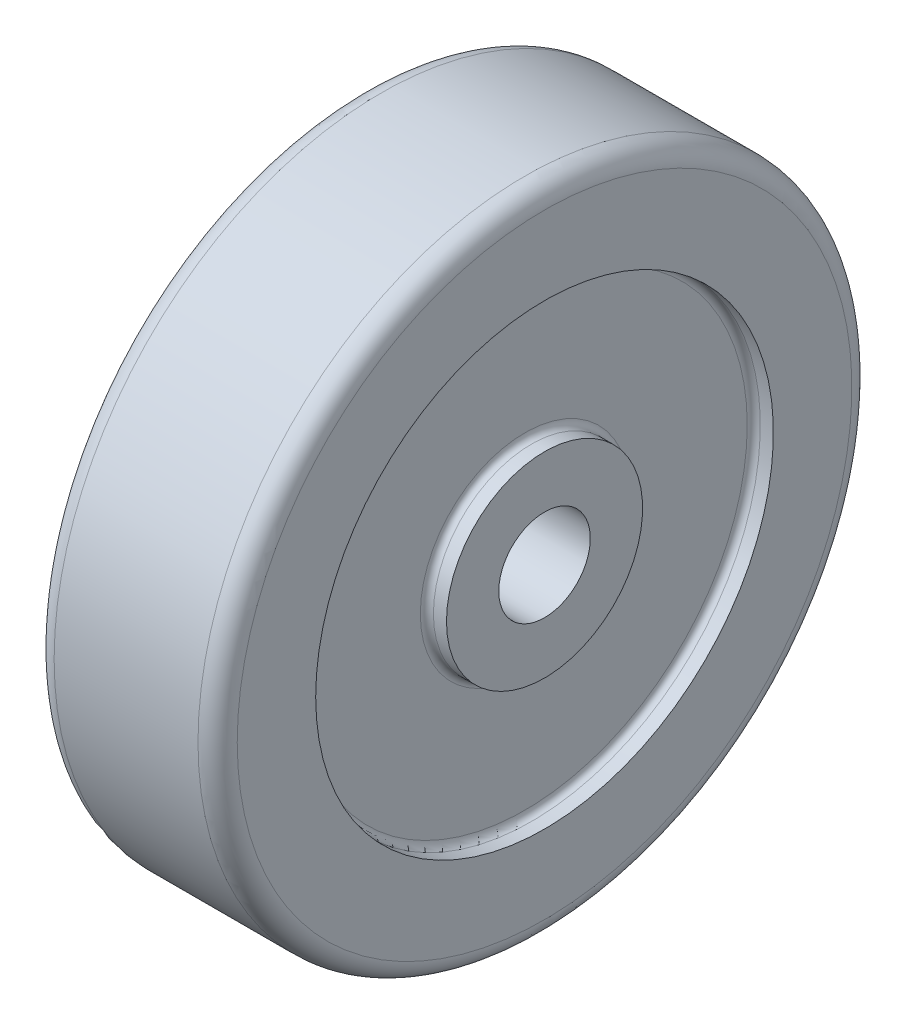
ISO-10303-21;
HEADER;
FILE_DESCRIPTION(('STEP AP214'),'2;1');
FILE_NAME('part.step','',(''),(''),'','','');
FILE_SCHEMA(('AUTOMOTIVE_DESIGN { 1 0 10303 214 1 1 1 1 }'));
ENDSEC;
DATA;
#1=APPLICATION_CONTEXT('core data for automotive mechanical design processes');
#2=APPLICATION_PROTOCOL_DEFINITION('international standard','automotive_design',2000,#1);
#3=PRODUCT_CONTEXT('',#1,'mechanical');
#4=PRODUCT('Part','Part','',(#3));
#5=PRODUCT_RELATED_PRODUCT_CATEGORY('part','',(#4));
#6=PRODUCT_DEFINITION_FORMATION('','',#4);
#7=PRODUCT_DEFINITION_CONTEXT('part definition',#1,'design');
#8=PRODUCT_DEFINITION('design','',#6,#7);
#9=PRODUCT_DEFINITION_SHAPE('','',#8);
#10=(LENGTH_UNIT() NAMED_UNIT(*) SI_UNIT(.MILLI.,.METRE.));
#11=(NAMED_UNIT(*) PLANE_ANGLE_UNIT() SI_UNIT($,.RADIAN.));
#12=(NAMED_UNIT(*) SI_UNIT($,.STERADIAN.) SOLID_ANGLE_UNIT());
#13=UNCERTAINTY_MEASURE_WITH_UNIT(LENGTH_MEASURE(1.E-05),#10,'distance_accuracy_value','');
#14=(GEOMETRIC_REPRESENTATION_CONTEXT(3) GLOBAL_UNCERTAINTY_ASSIGNED_CONTEXT((#13)) GLOBAL_UNIT_ASSIGNED_CONTEXT((#10,
#11,#12)) REPRESENTATION_CONTEXT('',''));
#15=CARTESIAN_POINT('',(0.,0.,0.));
#16=DIRECTION('',(0.,0.,1.));
#17=DIRECTION('',(1.,0.,0.));
#18=AXIS2_PLACEMENT_3D('',#15,#16,#17);
#19=CARTESIAN_POINT('',(-14.,7.,0.));
#20=DIRECTION('',(1.,0.,0.));
#21=DIRECTION('',(0.,0.,-1.));
#22=AXIS2_PLACEMENT_3D('',#19,#20,#21);
#23=PLANE('',#22);
#24=CARTESIAN_POINT('',(-14.,0.,0.));
#25=DIRECTION('',(-1.,0.,0.));
#26=DIRECTION('',(0.,0.,1.));
#27=AXIS2_PLACEMENT_3D('',#24,#25,#26);
#28=CIRCLE('',#27,7.);
#29=CARTESIAN_POINT('',(-14.,0.,7.));
#30=VERTEX_POINT('',#29);
#31=EDGE_CURVE('E92',#30,#30,#28,.T.);
#32=ORIENTED_EDGE('',*,*,#31,.F.);
#33=EDGE_LOOP('',(#32));
#34=FACE_BOUND('',#33,.T.);
#35=CARTESIAN_POINT('',(-14.,0.,0.));
#36=DIRECTION('',(-1.,0.,0.));
#37=DIRECTION('',(0.,0.,1.));
#38=AXIS2_PLACEMENT_3D('',#35,#36,#37);
#39=CIRCLE('',#38,15.);
#40=CARTESIAN_POINT('',(-14.,0.,15.));
#41=VERTEX_POINT('',#40);
#42=EDGE_CURVE('E77',#41,#41,#39,.T.);
#43=ORIENTED_EDGE('',*,*,#42,.T.);
#44=EDGE_LOOP('',(#43));
#45=FACE_BOUND('',#44,.T.);
#46=ADVANCED_FACE('F33',(#34,#45),#23,.F.);
#47=CARTESIAN_POINT('',(-38.0384689922481,0.,0.));
#48=DIRECTION('',(-1.,0.,0.));
#49=DIRECTION('',(0.,0.,1.));
#50=AXIS2_PLACEMENT_3D('',#47,#48,#49);
#51=CYLINDRICAL_SURFACE('',#50,15.);
#52=CARTESIAN_POINT('',(-12.,0.,0.));
#53=DIRECTION('',(1.,0.,0.));
#54=DIRECTION('',(0.,0.,-1.));
#55=AXIS2_PLACEMENT_3D('',#52,#53,#54);
#56=CIRCLE('',#55,15.);
#57=CARTESIAN_POINT('',(-12.,0.,-15.));
#58=VERTEX_POINT('',#57);
#59=EDGE_CURVE('E62',#58,#58,#56,.F.);
#60=ORIENTED_EDGE('',*,*,#59,.T.);
#61=EDGE_LOOP('',(#60));
#62=FACE_BOUND('',#61,.T.);
#63=ORIENTED_EDGE('',*,*,#42,.F.);
#64=EDGE_LOOP('',(#63));
#65=FACE_BOUND('',#64,.T.);
#66=ADVANCED_FACE('F100',(#62,#65),#51,.T.);
#67=CARTESIAN_POINT('',(-11.,15.,0.));
#68=DIRECTION('',(1.,0.,0.));
#69=DIRECTION('',(0.,0.,-1.));
#70=AXIS2_PLACEMENT_3D('',#67,#68,#69);
#71=PLANE('',#70);
#72=CARTESIAN_POINT('',(-11.,0.,0.));
#73=DIRECTION('',(1.,0.,0.));
#74=DIRECTION('',(0.,0.,-1.));
#75=AXIS2_PLACEMENT_3D('',#72,#73,#74);
#76=CIRCLE('',#75,16.);
#77=CARTESIAN_POINT('',(-11.,0.,-16.));
#78=VERTEX_POINT('',#77);
#79=EDGE_CURVE('E56',#78,#78,#76,.T.);
#80=ORIENTED_EDGE('',*,*,#79,.T.);
#81=EDGE_LOOP('',(#80));
#82=FACE_BOUND('',#81,.T.);
#83=CARTESIAN_POINT('',(-11.,0.,0.));
#84=DIRECTION('',(1.,0.,0.));
#85=DIRECTION('',(0.,0.,-1.));
#86=AXIS2_PLACEMENT_3D('',#83,#84,#85);
#87=CIRCLE('',#86,34.);
#88=CARTESIAN_POINT('',(-11.,0.,-34.));
#89=VERTEX_POINT('',#88);
#90=EDGE_CURVE('E59',#89,#89,#87,.F.);
#91=ORIENTED_EDGE('',*,*,#90,.T.);
#92=EDGE_LOOP('',(#91));
#93=FACE_BOUND('',#92,.T.);
#94=ADVANCED_FACE('F105',(#82,#93),#71,.F.);
#95=CARTESIAN_POINT('',(-38.0384689922481,0.,0.));
#96=DIRECTION('',(-1.,0.,0.));
#97=DIRECTION('',(0.,0.,1.));
#98=AXIS2_PLACEMENT_3D('',#95,#96,#97);
#99=CYLINDRICAL_SURFACE('',#98,35.);
#100=CARTESIAN_POINT('',(-12.,0.,0.));
#101=DIRECTION('',(1.,0.,0.));
#102=DIRECTION('',(0.,0.,-1.));
#103=AXIS2_PLACEMENT_3D('',#100,#101,#102);
#104=CIRCLE('',#103,35.);
#105=CARTESIAN_POINT('',(-12.,0.,-35.));
#106=VERTEX_POINT('',#105);
#107=EDGE_CURVE('E53',#106,#106,#104,.T.);
#108=ORIENTED_EDGE('',*,*,#107,.T.);
#109=EDGE_LOOP('',(#108));
#110=FACE_BOUND('',#109,.T.);
#111=CARTESIAN_POINT('',(-14.,0.,0.));
#112=DIRECTION('',(-1.,0.,0.));
#113=DIRECTION('',(0.,0.,1.));
#114=AXIS2_PLACEMENT_3D('',#111,#112,#113);
#115=CIRCLE('',#114,35.);
#116=CARTESIAN_POINT('',(-14.,0.,35.));
#117=VERTEX_POINT('',#116);
#118=EDGE_CURVE('E80',#117,#117,#115,.T.);
#119=ORIENTED_EDGE('',*,*,#118,.T.);
#120=EDGE_LOOP('',(#119));
#121=FACE_BOUND('',#120,.T.);
#122=ADVANCED_FACE('F111',(#110,#121),#99,.F.);
#123=CARTESIAN_POINT('',(-14.,35.,0.));
#124=DIRECTION('',(1.,0.,0.));
#125=DIRECTION('',(0.,0.,-1.));
#126=AXIS2_PLACEMENT_3D('',#123,#124,#125);
#127=PLANE('',#126);
#128=CARTESIAN_POINT('',(-14.,0.,0.));
#129=DIRECTION('',(1.,0.,0.));
#130=DIRECTION('',(0.,0.,-1.));
#131=AXIS2_PLACEMENT_3D('',#128,#129,#130);
#132=CIRCLE('',#131,47.);
#133=CARTESIAN_POINT('',(-14.,0.,-47.));
#134=VERTEX_POINT('',#133);
#135=EDGE_CURVE('E74',#134,#134,#132,.F.);
#136=ORIENTED_EDGE('',*,*,#135,.T.);
#137=EDGE_LOOP('',(#136));
#138=FACE_BOUND('',#137,.T.);
#139=ORIENTED_EDGE('',*,*,#118,.F.);
#140=EDGE_LOOP('',(#139));
#141=FACE_BOUND('',#140,.T.);
#142=ADVANCED_FACE('F156',(#138,#141),#127,.F.);
#143=CARTESIAN_POINT('',(-38.0384689922481,0.,0.));
#144=DIRECTION('',(-1.,0.,0.));
#145=DIRECTION('',(0.,0.,1.));
#146=AXIS2_PLACEMENT_3D('',#143,#144,#145);
#147=CYLINDRICAL_SURFACE('',#146,50.);
#148=CARTESIAN_POINT('',(-11.,0.,0.));
#149=DIRECTION('',(1.,0.,0.));
#150=DIRECTION('',(0.,0.,-1.));
#151=AXIS2_PLACEMENT_3D('',#148,#149,#150);
#152=CIRCLE('',#151,50.);
#153=CARTESIAN_POINT('',(-11.,0.,-50.));
#154=VERTEX_POINT('',#153);
#155=EDGE_CURVE('E68',#154,#154,#152,.T.);
#156=ORIENTED_EDGE('',*,*,#155,.T.);
#157=EDGE_LOOP('',(#156));
#158=FACE_BOUND('',#157,.T.);
#159=CARTESIAN_POINT('',(11.,0.,0.));
#160=DIRECTION('',(-1.,0.,0.));
#161=DIRECTION('',(0.,0.,1.));
#162=AXIS2_PLACEMENT_3D('',#159,#160,#161);
#163=CIRCLE('',#162,50.);
#164=CARTESIAN_POINT('',(11.,0.,50.));
#165=VERTEX_POINT('',#164);
#166=EDGE_CURVE('E71',#165,#165,#163,.T.);
#167=ORIENTED_EDGE('',*,*,#166,.T.);
#168=EDGE_LOOP('',(#167));
#169=FACE_BOUND('',#168,.T.);
#170=ADVANCED_FACE('F150',(#158,#169),#147,.T.);
#171=CARTESIAN_POINT('',(14.,50.,0.));
#172=DIRECTION('',(-1.,0.,0.));
#173=DIRECTION('',(0.,0.,1.));
#174=AXIS2_PLACEMENT_3D('',#171,#172,#173);
#175=PLANE('',#174);
#176=CARTESIAN_POINT('',(14.,0.,0.));
#177=DIRECTION('',(-1.,0.,0.));
#178=DIRECTION('',(0.,0.,1.));
#179=AXIS2_PLACEMENT_3D('',#176,#177,#178);
#180=CIRCLE('',#179,47.);
#181=CARTESIAN_POINT('',(14.,0.,47.));
#182=VERTEX_POINT('',#181);
#183=EDGE_CURVE('E65',#182,#182,#180,.F.);
#184=ORIENTED_EDGE('',*,*,#183,.T.);
#185=EDGE_LOOP('',(#184));
#186=FACE_BOUND('',#185,.T.);
#187=CARTESIAN_POINT('',(14.,0.,0.));
#188=DIRECTION('',(-1.,0.,0.));
#189=DIRECTION('',(0.,0.,1.));
#190=AXIS2_PLACEMENT_3D('',#187,#188,#189);
#191=CIRCLE('',#190,35.);
#192=CARTESIAN_POINT('',(14.,0.,35.));
#193=VERTEX_POINT('',#192);
#194=EDGE_CURVE('E83',#193,#193,#191,.T.);
#195=ORIENTED_EDGE('',*,*,#194,.T.);
#196=EDGE_LOOP('',(#195));
#197=FACE_BOUND('',#196,.T.);
#198=ADVANCED_FACE('F145',(#186,#197),#175,.F.);
#199=CARTESIAN_POINT('',(-38.0384689922481,0.,0.));
#200=DIRECTION('',(-1.,0.,0.));
#201=DIRECTION('',(0.,0.,1.));
#202=AXIS2_PLACEMENT_3D('',#199,#200,#201);
#203=CYLINDRICAL_SURFACE('',#202,35.);
#204=CARTESIAN_POINT('',(12.,0.,0.));
#205=DIRECTION('',(-1.,0.,0.));
#206=DIRECTION('',(0.,0.,1.));
#207=AXIS2_PLACEMENT_3D('',#204,#205,#206);
#208=CIRCLE('',#207,35.);
#209=CARTESIAN_POINT('',(12.,0.,35.));
#210=VERTEX_POINT('',#209);
#211=EDGE_CURVE('E48',#210,#210,#208,.T.);
#212=ORIENTED_EDGE('',*,*,#211,.T.);
#213=EDGE_LOOP('',(#212));
#214=FACE_BOUND('',#213,.T.);
#215=ORIENTED_EDGE('',*,*,#194,.F.);
#216=EDGE_LOOP('',(#215));
#217=FACE_BOUND('',#216,.T.);
#218=ADVANCED_FACE('F141',(#214,#217),#203,.F.);
#219=CARTESIAN_POINT('',(11.,35.,0.));
#220=DIRECTION('',(-1.,0.,0.));
#221=DIRECTION('',(0.,0.,1.));
#222=AXIS2_PLACEMENT_3D('',#219,#220,#221);
#223=PLANE('',#222);
#224=CARTESIAN_POINT('',(11.,0.,0.));
#225=DIRECTION('',(-1.,0.,0.));
#226=DIRECTION('',(0.,0.,1.));
#227=AXIS2_PLACEMENT_3D('',#224,#225,#226);
#228=CIRCLE('',#227,34.);
#229=CARTESIAN_POINT('',(11.,0.,34.));
#230=VERTEX_POINT('',#229);
#231=EDGE_CURVE('E40',#230,#230,#228,.F.);
#232=ORIENTED_EDGE('',*,*,#231,.T.);
#233=EDGE_LOOP('',(#232));
#234=FACE_BOUND('',#233,.T.);
#235=CARTESIAN_POINT('',(11.,0.,0.));
#236=DIRECTION('',(-1.,0.,0.));
#237=DIRECTION('',(0.,0.,1.));
#238=AXIS2_PLACEMENT_3D('',#235,#236,#237);
#239=CIRCLE('',#238,16.);
#240=CARTESIAN_POINT('',(11.,0.,16.));
#241=VERTEX_POINT('',#240);
#242=EDGE_CURVE('E44',#241,#241,#239,.T.);
#243=ORIENTED_EDGE('',*,*,#242,.T.);
#244=EDGE_LOOP('',(#243));
#245=FACE_BOUND('',#244,.T.);
#246=ADVANCED_FACE('F144',(#234,#245),#223,.F.);
#247=CARTESIAN_POINT('',(-38.0384689922481,0.,0.));
#248=DIRECTION('',(-1.,0.,0.));
#249=DIRECTION('',(0.,0.,1.));
#250=AXIS2_PLACEMENT_3D('',#247,#248,#249);
#251=CYLINDRICAL_SURFACE('',#250,15.);
#252=CARTESIAN_POINT('',(12.,0.,0.));
#253=DIRECTION('',(-1.,0.,0.));
#254=DIRECTION('',(0.,0.,1.));
#255=AXIS2_PLACEMENT_3D('',#252,#253,#254);
#256=CIRCLE('',#255,15.);
#257=CARTESIAN_POINT('',(12.,0.,15.));
#258=VERTEX_POINT('',#257);
#259=EDGE_CURVE('E11',#258,#258,#256,.F.);
#260=ORIENTED_EDGE('',*,*,#259,.T.);
#261=EDGE_LOOP('',(#260));
#262=FACE_BOUND('',#261,.T.);
#263=CARTESIAN_POINT('',(14.,0.,0.));
#264=DIRECTION('',(-1.,0.,0.));
#265=DIRECTION('',(0.,0.,1.));
#266=AXIS2_PLACEMENT_3D('',#263,#264,#265);
#267=CIRCLE('',#266,15.);
#268=CARTESIAN_POINT('',(14.,0.,15.));
#269=VERTEX_POINT('',#268);
#270=EDGE_CURVE('E86',#269,#269,#267,.T.);
#271=ORIENTED_EDGE('',*,*,#270,.T.);
#272=EDGE_LOOP('',(#271));
#273=FACE_BOUND('',#272,.T.);
#274=ADVANCED_FACE('F203',(#262,#273),#251,.T.);
#275=CARTESIAN_POINT('',(14.,15.,0.));
#276=DIRECTION('',(-1.,0.,0.));
#277=DIRECTION('',(0.,0.,1.));
#278=AXIS2_PLACEMENT_3D('',#275,#276,#277);
#279=PLANE('',#278);
#280=ORIENTED_EDGE('',*,*,#270,.F.);
#281=EDGE_LOOP('',(#280));
#282=FACE_BOUND('',#281,.T.);
#283=CARTESIAN_POINT('',(14.,0.,0.));
#284=DIRECTION('',(-1.,0.,0.));
#285=DIRECTION('',(0.,0.,1.));
#286=AXIS2_PLACEMENT_3D('',#283,#284,#285);
#287=CIRCLE('',#286,7.);
#288=CARTESIAN_POINT('',(14.,0.,7.));
#289=VERTEX_POINT('',#288);
#290=EDGE_CURVE('E89',#289,#289,#287,.T.);
#291=ORIENTED_EDGE('',*,*,#290,.T.);
#292=EDGE_LOOP('',(#291));
#293=FACE_BOUND('',#292,.T.);
#294=ADVANCED_FACE('F211',(#282,#293),#279,.F.);
#295=CARTESIAN_POINT('',(-38.0384689922481,0.,0.));
#296=DIRECTION('',(-1.,0.,0.));
#297=DIRECTION('',(0.,0.,1.));
#298=AXIS2_PLACEMENT_3D('',#295,#296,#297);
#299=CYLINDRICAL_SURFACE('',#298,7.);
#300=ORIENTED_EDGE('',*,*,#290,.F.);
#301=EDGE_LOOP('',(#300));
#302=FACE_BOUND('',#301,.T.);
#303=ORIENTED_EDGE('',*,*,#31,.T.);
#304=EDGE_LOOP('',(#303));
#305=FACE_BOUND('',#304,.T.);
#306=ADVANCED_FACE('F96',(#302,#305),#299,.F.);
#307=CARTESIAN_POINT('',(-11.,0.,0.));
#308=DIRECTION('',(1.,0.,0.));
#309=DIRECTION('',(0.,0.,-1.));
#310=AXIS2_PLACEMENT_3D('',#307,#308,#309);
#311=TOROIDAL_SURFACE('',#310,47.,3.);
#312=ORIENTED_EDGE('',*,*,#155,.F.);
#313=EDGE_LOOP('',(#312));
#314=FACE_BOUND('',#313,.T.);
#315=ORIENTED_EDGE('',*,*,#135,.F.);
#316=EDGE_LOOP('',(#315));
#317=FACE_BOUND('',#316,.T.);
#318=ADVANCED_FACE('F116',(#314,#317),#311,.T.);
#319=CARTESIAN_POINT('',(11.,0.,0.));
#320=DIRECTION('',(-1.,0.,0.));
#321=DIRECTION('',(0.,0.,1.));
#322=AXIS2_PLACEMENT_3D('',#319,#320,#321);
#323=TOROIDAL_SURFACE('',#322,47.,3.);
#324=ORIENTED_EDGE('',*,*,#183,.F.);
#325=EDGE_LOOP('',(#324));
#326=FACE_BOUND('',#325,.T.);
#327=ORIENTED_EDGE('',*,*,#166,.F.);
#328=EDGE_LOOP('',(#327));
#329=FACE_BOUND('',#328,.T.);
#330=ADVANCED_FACE('F119',(#326,#329),#323,.T.);
#331=CARTESIAN_POINT('',(-12.,0.,0.));
#332=DIRECTION('',(1.,0.,0.));
#333=DIRECTION('',(0.,0.,-1.));
#334=AXIS2_PLACEMENT_3D('',#331,#332,#333);
#335=TOROIDAL_SURFACE('',#334,16.,1.);
#336=ORIENTED_EDGE('',*,*,#79,.F.);
#337=EDGE_LOOP('',(#336));
#338=FACE_BOUND('',#337,.T.);
#339=ORIENTED_EDGE('',*,*,#59,.F.);
#340=EDGE_LOOP('',(#339));
#341=FACE_BOUND('',#340,.T.);
#342=ADVANCED_FACE('F123',(#338,#341),#335,.F.);
#343=CARTESIAN_POINT('',(-12.,0.,0.));
#344=DIRECTION('',(1.,0.,0.));
#345=DIRECTION('',(0.,0.,-1.));
#346=AXIS2_PLACEMENT_3D('',#343,#344,#345);
#347=TOROIDAL_SURFACE('',#346,34.,1.);
#348=ORIENTED_EDGE('',*,*,#107,.F.);
#349=EDGE_LOOP('',(#348));
#350=FACE_BOUND('',#349,.T.);
#351=ORIENTED_EDGE('',*,*,#90,.F.);
#352=EDGE_LOOP('',(#351));
#353=FACE_BOUND('',#352,.T.);
#354=ADVANCED_FACE('F127',(#350,#353),#347,.F.);
#355=CARTESIAN_POINT('',(12.,0.,0.));
#356=DIRECTION('',(-1.,0.,0.));
#357=DIRECTION('',(0.,0.,1.));
#358=AXIS2_PLACEMENT_3D('',#355,#356,#357);
#359=TOROIDAL_SURFACE('',#358,34.,1.);
#360=ORIENTED_EDGE('',*,*,#231,.F.);
#361=EDGE_LOOP('',(#360));
#362=FACE_BOUND('',#361,.T.);
#363=ORIENTED_EDGE('',*,*,#211,.F.);
#364=EDGE_LOOP('',(#363));
#365=FACE_BOUND('',#364,.T.);
#366=ADVANCED_FACE('F130',(#362,#365),#359,.F.);
#367=CARTESIAN_POINT('',(12.,0.,0.));
#368=DIRECTION('',(-1.,0.,0.));
#369=DIRECTION('',(0.,0.,1.));
#370=AXIS2_PLACEMENT_3D('',#367,#368,#369);
#371=TOROIDAL_SURFACE('',#370,16.,1.);
#372=ORIENTED_EDGE('',*,*,#259,.F.);
#373=EDGE_LOOP('',(#372));
#374=FACE_BOUND('',#373,.T.);
#375=ORIENTED_EDGE('',*,*,#242,.F.);
#376=EDGE_LOOP('',(#375));
#377=FACE_BOUND('',#376,.T.);
#378=ADVANCED_FACE('F35',(#374,#377),#371,.F.);
#379=CLOSED_SHELL('',(#46,#66,#94,#122,#142,#170,#198,#218,#246,#274,#294,#306,#318,#330,#342,
#354,#366,#378));
#380=MANIFOLD_SOLID_BREP('B2',#379);
#381=ADVANCED_BREP_SHAPE_REPRESENTATION('',(#18,#380),#14);
#382=SHAPE_DEFINITION_REPRESENTATION(#9,#381);
ENDSEC;
END-ISO-10303-21;
